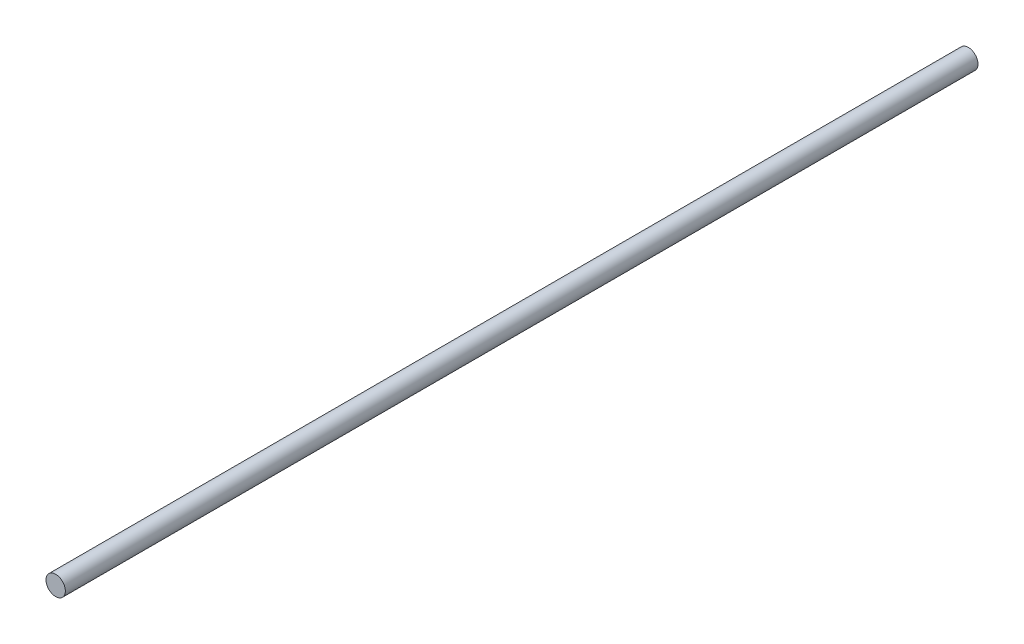
ISO-10303-21;
HEADER;
FILE_DESCRIPTION(('STEP AP214'),'2;1');
FILE_NAME('part.step','',(''),(''),'','','');
FILE_SCHEMA(('AUTOMOTIVE_DESIGN { 1 0 10303 214 1 1 1 1 }'));
ENDSEC;
DATA;
#1=APPLICATION_CONTEXT('core data for automotive mechanical design processes');
#2=APPLICATION_PROTOCOL_DEFINITION('international standard','automotive_design',2000,#1);
#3=PRODUCT_CONTEXT('',#1,'mechanical');
#4=PRODUCT('Part','Part','',(#3));
#5=PRODUCT_RELATED_PRODUCT_CATEGORY('part','',(#4));
#6=PRODUCT_DEFINITION_FORMATION('','',#4);
#7=PRODUCT_DEFINITION_CONTEXT('part definition',#1,'design');
#8=PRODUCT_DEFINITION('design','',#6,#7);
#9=PRODUCT_DEFINITION_SHAPE('','',#8);
#10=(LENGTH_UNIT() NAMED_UNIT(*) SI_UNIT(.MILLI.,.METRE.));
#11=(NAMED_UNIT(*) PLANE_ANGLE_UNIT() SI_UNIT($,.RADIAN.));
#12=(NAMED_UNIT(*) SI_UNIT($,.STERADIAN.) SOLID_ANGLE_UNIT());
#13=UNCERTAINTY_MEASURE_WITH_UNIT(LENGTH_MEASURE(1.E-05),#10,'distance_accuracy_value','');
#14=(GEOMETRIC_REPRESENTATION_CONTEXT(3) GLOBAL_UNCERTAINTY_ASSIGNED_CONTEXT((#13)) GLOBAL_UNIT_ASSIGNED_CONTEXT((#10,
#11,#12)) REPRESENTATION_CONTEXT('',''));
#15=CARTESIAN_POINT('',(0.,0.,0.));
#16=DIRECTION('',(0.,0.,1.));
#17=DIRECTION('',(1.,0.,0.));
#18=AXIS2_PLACEMENT_3D('',#15,#16,#17);
#19=CARTESIAN_POINT('',(0.,0.,141.25));
#20=DIRECTION('',(0.,0.,-1.));
#21=DIRECTION('',(-1.,0.,0.));
#22=AXIS2_PLACEMENT_3D('',#19,#20,#21);
#23=CYLINDRICAL_SURFACE('',#22,3.);
#24=CARTESIAN_POINT('',(0.,0.,141.25));
#25=DIRECTION('',(0.,0.,1.));
#26=DIRECTION('',(1.,0.,0.));
#27=AXIS2_PLACEMENT_3D('',#24,#25,#26);
#28=CIRCLE('',#27,3.);
#29=CARTESIAN_POINT('',(3.,0.,141.25));
#30=VERTEX_POINT('',#29);
#31=EDGE_CURVE('E10',#30,#30,#28,.T.);
#32=ORIENTED_EDGE('',*,*,#31,.F.);
#33=EDGE_LOOP('',(#32));
#34=FACE_BOUND('',#33,.T.);
#35=CARTESIAN_POINT('',(0.,0.,-141.25));
#36=DIRECTION('',(0.,0.,1.));
#37=DIRECTION('',(1.,0.,0.));
#38=AXIS2_PLACEMENT_3D('',#35,#36,#37);
#39=CIRCLE('',#38,3.);
#40=CARTESIAN_POINT('',(3.,0.,-141.25));
#41=VERTEX_POINT('',#40);
#42=EDGE_CURVE('E34',#41,#41,#39,.T.);
#43=ORIENTED_EDGE('',*,*,#42,.T.);
#44=EDGE_LOOP('',(#43));
#45=FACE_BOUND('',#44,.T.);
#46=ADVANCED_FACE('F31',(#34,#45),#23,.T.);
#47=CARTESIAN_POINT('',(0.,0.,141.25));
#48=DIRECTION('',(0.,0.,1.));
#49=DIRECTION('',(1.,0.,0.));
#50=AXIS2_PLACEMENT_3D('',#47,#48,#49);
#51=PLANE('',#50);
#52=ORIENTED_EDGE('',*,*,#31,.T.);
#53=EDGE_LOOP('',(#52));
#54=FACE_BOUND('',#53,.T.);
#55=ADVANCED_FACE('F46',(#54),#51,.T.);
#56=CARTESIAN_POINT('',(0.,0.,-141.25));
#57=DIRECTION('',(0.,0.,1.));
#58=DIRECTION('',(1.,0.,0.));
#59=AXIS2_PLACEMENT_3D('',#56,#57,#58);
#60=PLANE('',#59);
#61=ORIENTED_EDGE('',*,*,#42,.F.);
#62=EDGE_LOOP('',(#61));
#63=FACE_BOUND('',#62,.T.);
#64=ADVANCED_FACE('F44',(#63),#60,.F.);
#65=CLOSED_SHELL('',(#46,#55,#64));
#66=MANIFOLD_SOLID_BREP('B2',#65);
#67=ADVANCED_BREP_SHAPE_REPRESENTATION('',(#18,#66),#14);
#68=SHAPE_DEFINITION_REPRESENTATION(#9,#67);
ENDSEC;
END-ISO-10303-21;
